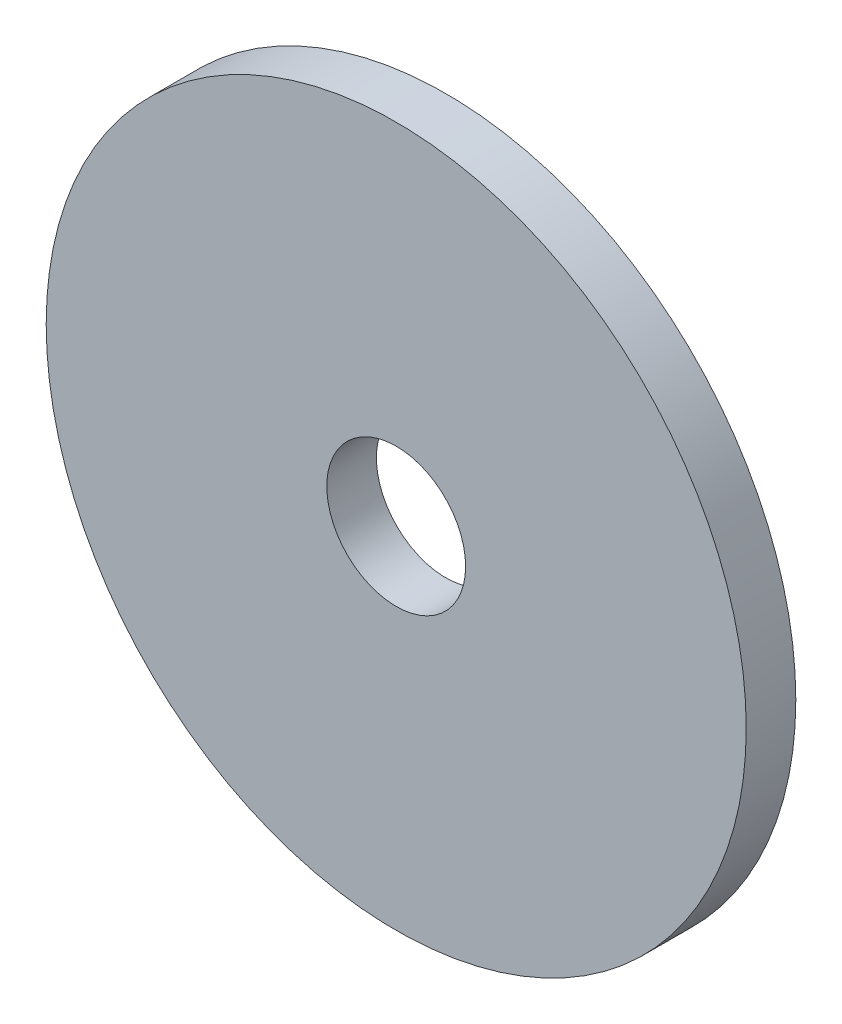
ISO-10303-21;
HEADER;
FILE_DESCRIPTION(('STEP AP214'),'2;1');
FILE_NAME('part.step','',(''),(''),'','','');
FILE_SCHEMA(('AUTOMOTIVE_DESIGN { 1 0 10303 214 1 1 1 1 }'));
ENDSEC;
DATA;
#1=APPLICATION_CONTEXT('core data for automotive mechanical design processes');
#2=APPLICATION_PROTOCOL_DEFINITION('international standard','automotive_design',2000,#1);
#3=PRODUCT_CONTEXT('',#1,'mechanical');
#4=PRODUCT('Part','Part','',(#3));
#5=PRODUCT_RELATED_PRODUCT_CATEGORY('part','',(#4));
#6=PRODUCT_DEFINITION_FORMATION('','',#4);
#7=PRODUCT_DEFINITION_CONTEXT('part definition',#1,'design');
#8=PRODUCT_DEFINITION('design','',#6,#7);
#9=PRODUCT_DEFINITION_SHAPE('','',#8);
#10=(LENGTH_UNIT() NAMED_UNIT(*) SI_UNIT(.MILLI.,.METRE.));
#11=(NAMED_UNIT(*) PLANE_ANGLE_UNIT() SI_UNIT($,.RADIAN.));
#12=(NAMED_UNIT(*) SI_UNIT($,.STERADIAN.) SOLID_ANGLE_UNIT());
#13=UNCERTAINTY_MEASURE_WITH_UNIT(LENGTH_MEASURE(1.E-05),#10,'distance_accuracy_value','');
#14=(GEOMETRIC_REPRESENTATION_CONTEXT(3) GLOBAL_UNCERTAINTY_ASSIGNED_CONTEXT((#13)) GLOBAL_UNIT_ASSIGNED_CONTEXT((#10,
#11,#12)) REPRESENTATION_CONTEXT('',''));
#15=CARTESIAN_POINT('',(0.,0.,0.));
#16=DIRECTION('',(0.,0.,1.));
#17=DIRECTION('',(1.,0.,0.));
#18=AXIS2_PLACEMENT_3D('',#15,#16,#17);
#19=CARTESIAN_POINT('',(0.,0.,0.635));
#20=DIRECTION('',(0.,0.,1.));
#21=DIRECTION('',(1.,0.,0.));
#22=AXIS2_PLACEMENT_3D('',#19,#20,#21);
#23=PLANE('',#22);
#24=CARTESIAN_POINT('',(0.,0.,0.635));
#25=DIRECTION('',(0.,0.,1.));
#26=DIRECTION('',(1.,0.,0.));
#27=AXIS2_PLACEMENT_3D('',#24,#25,#26);
#28=CIRCLE('',#27,4.4831);
#29=CARTESIAN_POINT('',(4.4831,0.,0.635));
#30=VERTEX_POINT('',#29);
#31=EDGE_CURVE('E10',#30,#30,#28,.T.);
#32=ORIENTED_EDGE('',*,*,#31,.T.);
#33=EDGE_LOOP('',(#32));
#34=FACE_BOUND('',#33,.T.);
#35=CARTESIAN_POINT('',(0.,0.,0.635));
#36=DIRECTION('',(0.,0.,1.));
#37=DIRECTION('',(1.,0.,0.));
#38=AXIS2_PLACEMENT_3D('',#35,#36,#37);
#39=CIRCLE('',#38,0.889);
#40=CARTESIAN_POINT('',(0.889,0.,0.635));
#41=VERTEX_POINT('',#40);
#42=EDGE_CURVE('E44',#41,#41,#39,.T.);
#43=ORIENTED_EDGE('',*,*,#42,.F.);
#44=EDGE_LOOP('',(#43));
#45=FACE_BOUND('',#44,.T.);
#46=ADVANCED_FACE('F33',(#34,#45),#23,.T.);
#47=CARTESIAN_POINT('',(0.,0.,0.));
#48=DIRECTION('',(0.,0.,1.));
#49=DIRECTION('',(1.,0.,0.));
#50=AXIS2_PLACEMENT_3D('',#47,#48,#49);
#51=PLANE('',#50);
#52=CARTESIAN_POINT('',(0.,0.,0.));
#53=DIRECTION('',(0.,0.,1.));
#54=DIRECTION('',(1.,0.,0.));
#55=AXIS2_PLACEMENT_3D('',#52,#53,#54);
#56=CIRCLE('',#55,4.4831);
#57=CARTESIAN_POINT('',(4.4831,0.,0.));
#58=VERTEX_POINT('',#57);
#59=EDGE_CURVE('E37',#58,#58,#56,.T.);
#60=ORIENTED_EDGE('',*,*,#59,.F.);
#61=EDGE_LOOP('',(#60));
#62=FACE_BOUND('',#61,.T.);
#63=CARTESIAN_POINT('',(0.,0.,0.));
#64=DIRECTION('',(0.,0.,1.));
#65=DIRECTION('',(1.,0.,0.));
#66=AXIS2_PLACEMENT_3D('',#63,#64,#65);
#67=CIRCLE('',#66,0.889);
#68=CARTESIAN_POINT('',(0.889,0.,0.));
#69=VERTEX_POINT('',#68);
#70=EDGE_CURVE('E46',#69,#69,#67,.T.);
#71=ORIENTED_EDGE('',*,*,#70,.T.);
#72=EDGE_LOOP('',(#71));
#73=FACE_BOUND('',#72,.T.);
#74=ADVANCED_FACE('F56',(#62,#73),#51,.F.);
#75=CARTESIAN_POINT('',(0.,0.,0.635));
#76=DIRECTION('',(0.,0.,-1.));
#77=DIRECTION('',(-1.,0.,0.));
#78=AXIS2_PLACEMENT_3D('',#75,#76,#77);
#79=CYLINDRICAL_SURFACE('',#78,4.4831);
#80=ORIENTED_EDGE('',*,*,#31,.F.);
#81=EDGE_LOOP('',(#80));
#82=FACE_BOUND('',#81,.T.);
#83=ORIENTED_EDGE('',*,*,#59,.T.);
#84=EDGE_LOOP('',(#83));
#85=FACE_BOUND('',#84,.T.);
#86=ADVANCED_FACE('F35',(#82,#85),#79,.T.);
#87=CARTESIAN_POINT('',(0.,0.,0.635));
#88=DIRECTION('',(0.,0.,-1.));
#89=DIRECTION('',(-1.,0.,0.));
#90=AXIS2_PLACEMENT_3D('',#87,#88,#89);
#91=CYLINDRICAL_SURFACE('',#90,0.889);
#92=ORIENTED_EDGE('',*,*,#42,.T.);
#93=EDGE_LOOP('',(#92));
#94=FACE_BOUND('',#93,.T.);
#95=ORIENTED_EDGE('',*,*,#70,.F.);
#96=EDGE_LOOP('',(#95));
#97=FACE_BOUND('',#96,.T.);
#98=ADVANCED_FACE('F52',(#94,#97),#91,.F.);
#99=CLOSED_SHELL('',(#46,#74,#86,#98));
#100=MANIFOLD_SOLID_BREP('B2',#99);
#101=ADVANCED_BREP_SHAPE_REPRESENTATION('',(#18,#100),#14);
#102=SHAPE_DEFINITION_REPRESENTATION(#9,#101);
ENDSEC;
END-ISO-10303-21;
